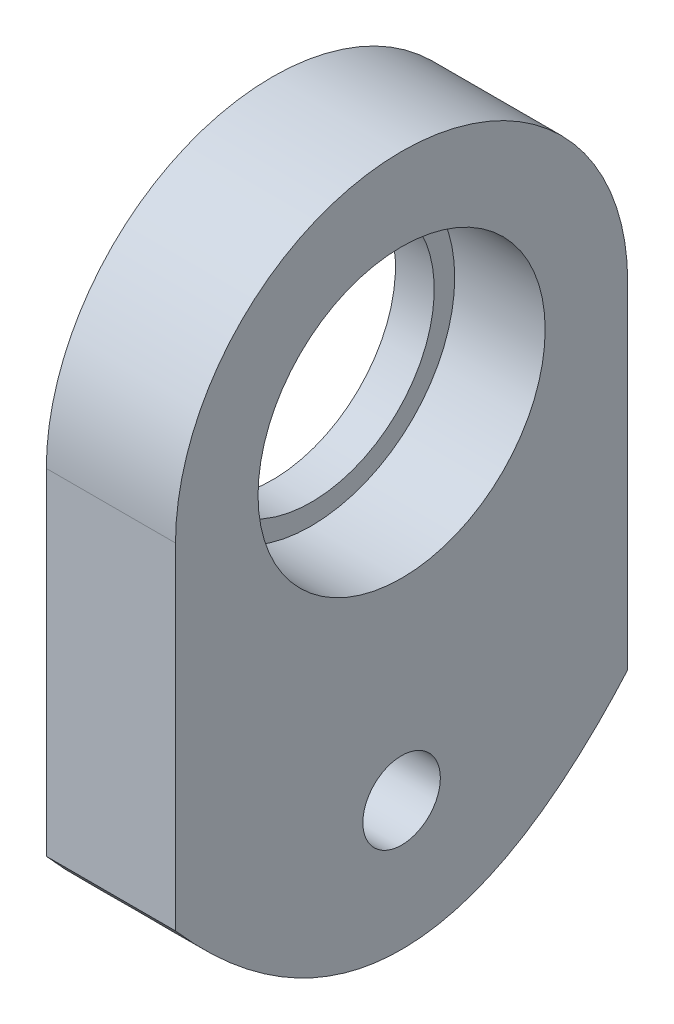
ISO-10303-21;
HEADER;
FILE_DESCRIPTION(('STEP AP214'),'2;1');
FILE_NAME('part.step','',(''),(''),'','','');
FILE_SCHEMA(('AUTOMOTIVE_DESIGN { 1 0 10303 214 1 1 1 1 }'));
ENDSEC;
DATA;
#1=APPLICATION_CONTEXT('core data for automotive mechanical design processes');
#2=APPLICATION_PROTOCOL_DEFINITION('international standard','automotive_design',2000,#1);
#3=PRODUCT_CONTEXT('',#1,'mechanical');
#4=PRODUCT('Part','Part','',(#3));
#5=PRODUCT_RELATED_PRODUCT_CATEGORY('part','',(#4));
#6=PRODUCT_DEFINITION_FORMATION('','',#4);
#7=PRODUCT_DEFINITION_CONTEXT('part definition',#1,'design');
#8=PRODUCT_DEFINITION('design','',#6,#7);
#9=PRODUCT_DEFINITION_SHAPE('','',#8);
#10=(LENGTH_UNIT() NAMED_UNIT(*) SI_UNIT(.MILLI.,.METRE.));
#11=(NAMED_UNIT(*) PLANE_ANGLE_UNIT() SI_UNIT($,.RADIAN.));
#12=(NAMED_UNIT(*) SI_UNIT($,.STERADIAN.) SOLID_ANGLE_UNIT());
#13=UNCERTAINTY_MEASURE_WITH_UNIT(LENGTH_MEASURE(1.E-05),#10,'distance_accuracy_value','');
#14=(GEOMETRIC_REPRESENTATION_CONTEXT(3) GLOBAL_UNCERTAINTY_ASSIGNED_CONTEXT((#13)) GLOBAL_UNIT_ASSIGNED_CONTEXT((#10,
#11,#12)) REPRESENTATION_CONTEXT('',''));
#15=CARTESIAN_POINT('',(0.,0.,0.));
#16=DIRECTION('',(0.,0.,1.));
#17=DIRECTION('',(1.,0.,0.));
#18=AXIS2_PLACEMENT_3D('',#15,#16,#17);
#19=CARTESIAN_POINT('',(10.,0.,0.));
#20=DIRECTION('',(-1.,0.,0.));
#21=DIRECTION('',(0.,0.,1.));
#22=AXIS2_PLACEMENT_3D('',#19,#20,#21);
#23=CYLINDRICAL_SURFACE('',#22,11.1125);
#24=CARTESIAN_POINT('',(10.,0.,0.));
#25=DIRECTION('',(-1.,0.,0.));
#26=DIRECTION('',(0.,0.,1.));
#27=AXIS2_PLACEMENT_3D('',#24,#25,#26);
#28=CIRCLE('',#27,11.1125);
#29=CARTESIAN_POINT('',(10.,0.,11.1125));
#30=VERTEX_POINT('',#29);
#31=EDGE_CURVE('E114',#30,#30,#28,.T.);
#32=ORIENTED_EDGE('',*,*,#31,.F.);
#33=EDGE_LOOP('',(#32));
#34=FACE_BOUND('',#33,.T.);
#35=CARTESIAN_POINT('',(3.,0.,0.));
#36=DIRECTION('',(-1.,0.,0.));
#37=DIRECTION('',(0.,0.,1.));
#38=AXIS2_PLACEMENT_3D('',#35,#36,#37);
#39=CIRCLE('',#38,11.1125);
#40=CARTESIAN_POINT('',(3.,0.,11.1125));
#41=VERTEX_POINT('',#40);
#42=EDGE_CURVE('E12',#41,#41,#39,.F.);
#43=ORIENTED_EDGE('',*,*,#42,.F.);
#44=EDGE_LOOP('',(#43));
#45=FACE_BOUND('',#44,.T.);
#46=ADVANCED_FACE('F42',(#34,#45),#23,.F.);
#47=CARTESIAN_POINT('',(10.,0.,17.5));
#48=DIRECTION('',(0.,0.,-1.));
#49=DIRECTION('',(-1.,0.,0.));
#50=AXIS2_PLACEMENT_3D('',#47,#48,#49);
#51=PLANE('',#50);
#52=DIRECTION('',(0.,-1.,0.));
#53=VECTOR('',#52,1.);
#54=CARTESIAN_POINT('',(0.,0.,17.5));
#55=LINE('',#54,#53);
#56=CARTESIAN_POINT('',(0.,0.,17.5));
#57=VERTEX_POINT('',#56);
#58=CARTESIAN_POINT('',(0.,-26.,17.5));
#59=VERTEX_POINT('',#58);
#60=EDGE_CURVE('E111',#57,#59,#55,.T.);
#61=ORIENTED_EDGE('',*,*,#60,.T.);
#62=DIRECTION('',(-1.,0.,0.));
#63=VECTOR('',#62,1.);
#64=CARTESIAN_POINT('',(10.,-26.,17.5));
#65=LINE('',#64,#63);
#66=CARTESIAN_POINT('',(10.,-26.,17.5));
#67=VERTEX_POINT('',#66);
#68=EDGE_CURVE('E51',#67,#59,#65,.T.);
#69=ORIENTED_EDGE('',*,*,#68,.F.);
#70=DIRECTION('',(0.,-1.,0.));
#71=VECTOR('',#70,1.);
#72=CARTESIAN_POINT('',(10.,0.,17.5));
#73=LINE('',#72,#71);
#74=CARTESIAN_POINT('',(10.,0.,17.5));
#75=VERTEX_POINT('',#74);
#76=EDGE_CURVE('E91',#75,#67,#73,.T.);
#77=ORIENTED_EDGE('',*,*,#76,.F.);
#78=DIRECTION('',(-1.,0.,0.));
#79=VECTOR('',#78,1.);
#80=CARTESIAN_POINT('',(10.,0.,17.5));
#81=LINE('',#80,#79);
#82=EDGE_CURVE('E104',#75,#57,#81,.T.);
#83=ORIENTED_EDGE('',*,*,#82,.T.);
#84=EDGE_LOOP('',(#61,#69,#77,#83));
#85=FACE_BOUND('',#84,.T.);
#86=ADVANCED_FACE('F44',(#85),#51,.F.);
#87=CARTESIAN_POINT('',(10.,-26.,17.5));
#88=CARTESIAN_POINT('',(10.,-46.,0.));
#89=CARTESIAN_POINT('',(10.,-26.,-17.5));
#90=B_SPLINE_CURVE_WITH_KNOTS('',2,(#87,#88,#89),.UNSPECIFIED.,.F.,.F.,(3,3),(0.,1.),.UNSPECIFIED.);
#91=DIRECTION('',(-1.,0.,0.));
#92=VECTOR('',#91,1.);
#93=SURFACE_OF_LINEAR_EXTRUSION('',#90,#92);
#94=CARTESIAN_POINT('',(0.,-26.,17.5));
#95=CARTESIAN_POINT('',(0.,-46.,0.));
#96=CARTESIAN_POINT('',(0.,-26.,-17.5));
#97=B_SPLINE_CURVE_WITH_KNOTS('',2,(#94,#95,#96),.UNSPECIFIED.,.F.,.F.,(3,3),(0.,1.),.UNSPECIFIED.);
#98=CARTESIAN_POINT('',(0.,-26.,-17.5));
#99=VERTEX_POINT('',#98);
#100=EDGE_CURVE('E97',#59,#99,#97,.T.);
#101=ORIENTED_EDGE('',*,*,#100,.T.);
#102=DIRECTION('',(-1.,0.,0.));
#103=VECTOR('',#102,1.);
#104=CARTESIAN_POINT('',(10.,-26.,-17.5));
#105=LINE('',#104,#103);
#106=CARTESIAN_POINT('',(10.,-26.,-17.5));
#107=VERTEX_POINT('',#106);
#108=EDGE_CURVE('E95',#107,#99,#105,.T.);
#109=ORIENTED_EDGE('',*,*,#108,.F.);
#110=EDGE_CURVE('E86',#67,#107,#90,.T.);
#111=ORIENTED_EDGE('',*,*,#110,.F.);
#112=ORIENTED_EDGE('',*,*,#68,.T.);
#113=EDGE_LOOP('',(#101,#109,#111,#112));
#114=FACE_BOUND('',#113,.T.);
#115=ADVANCED_FACE('F96',(#114),#93,.F.);
#116=CARTESIAN_POINT('',(10.,0.,-17.5));
#117=DIRECTION('',(0.,0.,-1.));
#118=DIRECTION('',(-1.,0.,0.));
#119=AXIS2_PLACEMENT_3D('',#116,#117,#118);
#120=PLANE('',#119);
#121=DIRECTION('',(0.,-1.,0.));
#122=VECTOR('',#121,1.);
#123=CARTESIAN_POINT('',(0.,0.,-17.5));
#124=LINE('',#123,#122);
#125=CARTESIAN_POINT('',(0.,0.,-17.5));
#126=VERTEX_POINT('',#125);
#127=EDGE_CURVE('E118',#126,#99,#124,.T.);
#128=ORIENTED_EDGE('',*,*,#127,.F.);
#129=DIRECTION('',(-1.,0.,0.));
#130=VECTOR('',#129,1.);
#131=CARTESIAN_POINT('',(10.,0.,-17.5));
#132=LINE('',#131,#130);
#133=CARTESIAN_POINT('',(10.,0.,-17.5));
#134=VERTEX_POINT('',#133);
#135=EDGE_CURVE('E75',#134,#126,#132,.T.);
#136=ORIENTED_EDGE('',*,*,#135,.F.);
#137=DIRECTION('',(0.,-1.,0.));
#138=VECTOR('',#137,1.);
#139=CARTESIAN_POINT('',(10.,0.,-17.5));
#140=LINE('',#139,#138);
#141=EDGE_CURVE('E89',#134,#107,#140,.T.);
#142=ORIENTED_EDGE('',*,*,#141,.T.);
#143=ORIENTED_EDGE('',*,*,#108,.T.);
#144=EDGE_LOOP('',(#128,#136,#142,#143));
#145=FACE_BOUND('',#144,.T.);
#146=ADVANCED_FACE('F102',(#145),#120,.T.);
#147=CARTESIAN_POINT('',(10.,0.,0.));
#148=DIRECTION('',(-1.,0.,0.));
#149=DIRECTION('',(0.,0.,1.));
#150=AXIS2_PLACEMENT_3D('',#147,#148,#149);
#151=CYLINDRICAL_SURFACE('',#150,17.5);
#152=CARTESIAN_POINT('',(0.,0.,0.));
#153=DIRECTION('',(1.,0.,0.));
#154=DIRECTION('',(0.,0.,-1.));
#155=AXIS2_PLACEMENT_3D('',#152,#153,#154);
#156=CIRCLE('',#155,17.5);
#157=EDGE_CURVE('E78',#126,#57,#156,.T.);
#158=ORIENTED_EDGE('',*,*,#157,.T.);
#159=ORIENTED_EDGE('',*,*,#82,.F.);
#160=CARTESIAN_POINT('',(10.,0.,0.));
#161=DIRECTION('',(1.,0.,0.));
#162=DIRECTION('',(0.,0.,-1.));
#163=AXIS2_PLACEMENT_3D('',#160,#161,#162);
#164=CIRCLE('',#163,17.5);
#165=EDGE_CURVE('E59',#134,#75,#164,.T.);
#166=ORIENTED_EDGE('',*,*,#165,.F.);
#167=ORIENTED_EDGE('',*,*,#135,.T.);
#168=EDGE_LOOP('',(#158,#159,#166,#167));
#169=FACE_BOUND('',#168,.T.);
#170=ADVANCED_FACE('F170',(#169),#151,.T.);
#171=CARTESIAN_POINT('',(10.,0.,0.));
#172=DIRECTION('',(1.,0.,0.));
#173=DIRECTION('',(0.,0.,-1.));
#174=AXIS2_PLACEMENT_3D('',#171,#172,#173);
#175=PLANE('',#174);
#176=CARTESIAN_POINT('',(10.,-26.,0.));
#177=DIRECTION('',(1.,0.,0.));
#178=DIRECTION('',(0.,0.,-1.));
#179=AXIS2_PLACEMENT_3D('',#176,#177,#178);
#180=CIRCLE('',#179,3.);
#181=CARTESIAN_POINT('',(10.,-26.,-3.));
#182=VERTEX_POINT('',#181);
#183=EDGE_CURVE('E144',#182,#182,#180,.T.);
#184=ORIENTED_EDGE('',*,*,#183,.F.);
#185=EDGE_LOOP('',(#184));
#186=FACE_BOUND('',#185,.T.);
#187=ORIENTED_EDGE('',*,*,#31,.T.);
#188=EDGE_LOOP('',(#187));
#189=FACE_BOUND('',#188,.T.);
#190=ORIENTED_EDGE('',*,*,#141,.F.);
#191=ORIENTED_EDGE('',*,*,#165,.T.);
#192=ORIENTED_EDGE('',*,*,#76,.T.);
#193=ORIENTED_EDGE('',*,*,#110,.T.);
#194=EDGE_LOOP('',(#190,#191,#192,#193));
#195=FACE_BOUND('',#194,.T.);
#196=ADVANCED_FACE('F87',(#186,#189,#195),#175,.T.);
#197=CARTESIAN_POINT('',(0.,0.,0.));
#198=DIRECTION('',(1.,0.,0.));
#199=DIRECTION('',(0.,0.,-1.));
#200=AXIS2_PLACEMENT_3D('',#197,#198,#199);
#201=PLANE('',#200);
#202=CARTESIAN_POINT('',(0.,-26.,0.));
#203=DIRECTION('',(1.,0.,0.));
#204=DIRECTION('',(0.,0.,-1.));
#205=AXIS2_PLACEMENT_3D('',#202,#203,#204);
#206=CIRCLE('',#205,3.);
#207=CARTESIAN_POINT('',(0.,-26.,-3.));
#208=VERTEX_POINT('',#207);
#209=EDGE_CURVE('E139',#208,#208,#206,.T.);
#210=ORIENTED_EDGE('',*,*,#209,.T.);
#211=EDGE_LOOP('',(#210));
#212=FACE_BOUND('',#211,.T.);
#213=ORIENTED_EDGE('',*,*,#60,.F.);
#214=ORIENTED_EDGE('',*,*,#157,.F.);
#215=ORIENTED_EDGE('',*,*,#127,.T.);
#216=ORIENTED_EDGE('',*,*,#100,.F.);
#217=EDGE_LOOP('',(#213,#214,#215,#216));
#218=FACE_BOUND('',#217,.T.);
#219=CARTESIAN_POINT('',(0.,0.,0.));
#220=DIRECTION('',(-1.,0.,0.));
#221=DIRECTION('',(0.,0.,1.));
#222=AXIS2_PLACEMENT_3D('',#219,#220,#221);
#223=CIRCLE('',#222,9.525);
#224=CARTESIAN_POINT('',(0.,0.,9.525));
#225=VERTEX_POINT('',#224);
#226=EDGE_CURVE('E136',#225,#225,#223,.T.);
#227=ORIENTED_EDGE('',*,*,#226,.F.);
#228=EDGE_LOOP('',(#227));
#229=FACE_BOUND('',#228,.T.);
#230=ADVANCED_FACE('F128',(#212,#218,#229),#201,.F.);
#231=CARTESIAN_POINT('',(3.,0.,0.));
#232=DIRECTION('',(-1.,0.,0.));
#233=DIRECTION('',(0.,0.,1.));
#234=AXIS2_PLACEMENT_3D('',#231,#232,#233);
#235=PLANE('',#234);
#236=CARTESIAN_POINT('',(3.,0.,0.));
#237=DIRECTION('',(-1.,0.,0.));
#238=DIRECTION('',(0.,0.,1.));
#239=AXIS2_PLACEMENT_3D('',#236,#237,#238);
#240=CIRCLE('',#239,9.525);
#241=CARTESIAN_POINT('',(3.,0.,9.525));
#242=VERTEX_POINT('',#241);
#243=EDGE_CURVE('E138',#242,#242,#240,.T.);
#244=ORIENTED_EDGE('',*,*,#243,.T.);
#245=EDGE_LOOP('',(#244));
#246=FACE_BOUND('',#245,.T.);
#247=ORIENTED_EDGE('',*,*,#42,.T.);
#248=EDGE_LOOP('',(#247));
#249=FACE_BOUND('',#248,.T.);
#250=ADVANCED_FACE('F131',(#246,#249),#235,.F.);
#251=CARTESIAN_POINT('',(3.,0.,0.));
#252=DIRECTION('',(-1.,0.,0.));
#253=DIRECTION('',(0.,0.,1.));
#254=AXIS2_PLACEMENT_3D('',#251,#252,#253);
#255=CYLINDRICAL_SURFACE('',#254,9.525);
#256=ORIENTED_EDGE('',*,*,#243,.F.);
#257=EDGE_LOOP('',(#256));
#258=FACE_BOUND('',#257,.T.);
#259=ORIENTED_EDGE('',*,*,#226,.T.);
#260=EDGE_LOOP('',(#259));
#261=FACE_BOUND('',#260,.T.);
#262=ADVANCED_FACE('F158',(#258,#261),#255,.F.);
#263=CARTESIAN_POINT('',(0.,-26.,0.));
#264=DIRECTION('',(1.,0.,0.));
#265=DIRECTION('',(0.,0.,-1.));
#266=AXIS2_PLACEMENT_3D('',#263,#264,#265);
#267=CYLINDRICAL_SURFACE('',#266,3.);
#268=ORIENTED_EDGE('',*,*,#209,.F.);
#269=EDGE_LOOP('',(#268));
#270=FACE_BOUND('',#269,.T.);
#271=ORIENTED_EDGE('',*,*,#183,.T.);
#272=EDGE_LOOP('',(#271));
#273=FACE_BOUND('',#272,.T.);
#274=ADVANCED_FACE('F164',(#270,#273),#267,.F.);
#275=CLOSED_SHELL('',(#46,#86,#115,#146,#170,#196,#230,#250,#262,#274));
#276=MANIFOLD_SOLID_BREP('B2',#275);
#277=ADVANCED_BREP_SHAPE_REPRESENTATION('',(#18,#276),#14);
#278=SHAPE_DEFINITION_REPRESENTATION(#9,#277);
ENDSEC;
END-ISO-10303-21;
